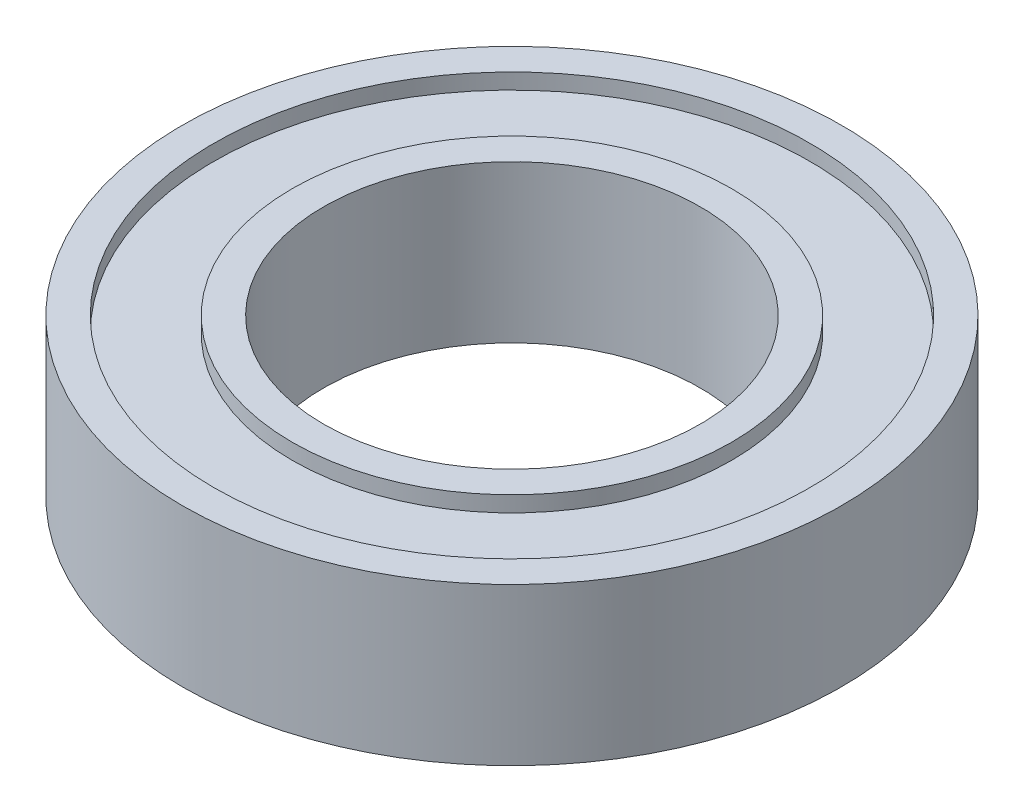
ISO-10303-21;
HEADER;
FILE_DESCRIPTION(('STEP AP214'),'2;1');
FILE_NAME('part.step','',(''),(''),'','','');
FILE_SCHEMA(('AUTOMOTIVE_DESIGN { 1 0 10303 214 1 1 1 1 }'));
ENDSEC;
DATA;
#1=APPLICATION_CONTEXT('core data for automotive mechanical design processes');
#2=APPLICATION_PROTOCOL_DEFINITION('international standard','automotive_design',2000,#1);
#3=PRODUCT_CONTEXT('',#1,'mechanical');
#4=PRODUCT('Part','Part','',(#3));
#5=PRODUCT_RELATED_PRODUCT_CATEGORY('part','',(#4));
#6=PRODUCT_DEFINITION_FORMATION('','',#4);
#7=PRODUCT_DEFINITION_CONTEXT('part definition',#1,'design');
#8=PRODUCT_DEFINITION('design','',#6,#7);
#9=PRODUCT_DEFINITION_SHAPE('','',#8);
#10=(LENGTH_UNIT() NAMED_UNIT(*) SI_UNIT(.MILLI.,.METRE.));
#11=(NAMED_UNIT(*) PLANE_ANGLE_UNIT() SI_UNIT($,.RADIAN.));
#12=(NAMED_UNIT(*) SI_UNIT($,.STERADIAN.) SOLID_ANGLE_UNIT());
#13=UNCERTAINTY_MEASURE_WITH_UNIT(LENGTH_MEASURE(1.E-05),#10,'distance_accuracy_value','');
#14=(GEOMETRIC_REPRESENTATION_CONTEXT(3) GLOBAL_UNCERTAINTY_ASSIGNED_CONTEXT((#13)) GLOBAL_UNIT_ASSIGNED_CONTEXT((#10,
#11,#12)) REPRESENTATION_CONTEXT('',''));
#15=CARTESIAN_POINT('',(0.,0.,0.));
#16=DIRECTION('',(0.,0.,1.));
#17=DIRECTION('',(1.,0.,0.));
#18=AXIS2_PLACEMENT_3D('',#15,#16,#17);
#19=CARTESIAN_POINT('',(0.,-2.5,0.));
#20=DIRECTION('',(0.,1.,0.));
#21=DIRECTION('',(0.,0.,1.));
#22=AXIS2_PLACEMENT_3D('',#19,#20,#21);
#23=CYLINDRICAL_SURFACE('',#22,7.);
#24=CARTESIAN_POINT('',(0.,-2.5,0.));
#25=DIRECTION('',(0.,1.,0.));
#26=DIRECTION('',(0.,0.,1.));
#27=AXIS2_PLACEMENT_3D('',#24,#25,#26);
#28=CIRCLE('',#27,7.);
#29=CARTESIAN_POINT('',(0.,-2.5,7.));
#30=VERTEX_POINT('',#29);
#31=EDGE_CURVE('E51',#30,#30,#28,.T.);
#32=ORIENTED_EDGE('',*,*,#31,.T.);
#33=EDGE_LOOP('',(#32));
#34=FACE_BOUND('',#33,.T.);
#35=CARTESIAN_POINT('',(0.,-2.,0.));
#36=DIRECTION('',(0.,1.,0.));
#37=DIRECTION('',(0.,0.,1.));
#38=AXIS2_PLACEMENT_3D('',#35,#36,#37);
#39=CIRCLE('',#38,7.);
#40=CARTESIAN_POINT('',(0.,-2.,7.));
#41=VERTEX_POINT('',#40);
#42=EDGE_CURVE('E70',#41,#41,#39,.T.);
#43=ORIENTED_EDGE('',*,*,#42,.F.);
#44=EDGE_LOOP('',(#43));
#45=FACE_BOUND('',#44,.T.);
#46=ADVANCED_FACE('F44',(#34,#45),#23,.T.);
#47=CARTESIAN_POINT('',(0.,-2.5,0.));
#48=DIRECTION('',(0.,1.,0.));
#49=DIRECTION('',(0.,0.,1.));
#50=AXIS2_PLACEMENT_3D('',#47,#48,#49);
#51=CYLINDRICAL_SURFACE('',#50,6.);
#52=CARTESIAN_POINT('',(0.,-2.5,0.));
#53=DIRECTION('',(0.,1.,0.));
#54=DIRECTION('',(0.,0.,1.));
#55=AXIS2_PLACEMENT_3D('',#52,#53,#54);
#56=CIRCLE('',#55,6.);
#57=CARTESIAN_POINT('',(0.,-2.5,6.));
#58=VERTEX_POINT('',#57);
#59=EDGE_CURVE('E55',#58,#58,#56,.T.);
#60=ORIENTED_EDGE('',*,*,#59,.F.);
#61=EDGE_LOOP('',(#60));
#62=FACE_BOUND('',#61,.T.);
#63=CARTESIAN_POINT('',(0.,2.5,0.));
#64=DIRECTION('',(0.,1.,0.));
#65=DIRECTION('',(0.,0.,1.));
#66=AXIS2_PLACEMENT_3D('',#63,#64,#65);
#67=CIRCLE('',#66,6.);
#68=CARTESIAN_POINT('',(0.,2.5,6.));
#69=VERTEX_POINT('',#68);
#70=EDGE_CURVE('E64',#69,#69,#67,.T.);
#71=ORIENTED_EDGE('',*,*,#70,.T.);
#72=EDGE_LOOP('',(#71));
#73=FACE_BOUND('',#72,.T.);
#74=ADVANCED_FACE('F46',(#62,#73),#51,.F.);
#75=CARTESIAN_POINT('',(0.,2.,0.));
#76=DIRECTION('',(0.,1.,0.));
#77=DIRECTION('',(0.,0.,1.));
#78=AXIS2_PLACEMENT_3D('',#75,#76,#77);
#79=CIRCLE('',#78,7.);
#80=CARTESIAN_POINT('',(0.,2.,7.));
#81=VERTEX_POINT('',#80);
#82=EDGE_CURVE('E11',#81,#81,#79,.F.);
#83=ORIENTED_EDGE('',*,*,#82,.F.);
#84=EDGE_LOOP('',(#83));
#85=FACE_BOUND('',#84,.T.);
#86=CARTESIAN_POINT('',(0.,2.5,0.));
#87=DIRECTION('',(0.,1.,0.));
#88=DIRECTION('',(0.,0.,1.));
#89=AXIS2_PLACEMENT_3D('',#86,#87,#88);
#90=CIRCLE('',#89,7.);
#91=CARTESIAN_POINT('',(0.,2.5,7.));
#92=VERTEX_POINT('',#91);
#93=EDGE_CURVE('E59',#92,#92,#90,.T.);
#94=ORIENTED_EDGE('',*,*,#93,.F.);
#95=EDGE_LOOP('',(#94));
#96=FACE_BOUND('',#95,.T.);
#97=ADVANCED_FACE('F112',(#85,#96),#23,.T.);
#98=CARTESIAN_POINT('',(0.,-2.5,0.));
#99=DIRECTION('',(0.,1.,0.));
#100=DIRECTION('',(0.,0.,1.));
#101=AXIS2_PLACEMENT_3D('',#98,#99,#100);
#102=PLANE('',#101);
#103=ORIENTED_EDGE('',*,*,#59,.T.);
#104=EDGE_LOOP('',(#103));
#105=FACE_BOUND('',#104,.T.);
#106=ORIENTED_EDGE('',*,*,#31,.F.);
#107=EDGE_LOOP('',(#106));
#108=FACE_BOUND('',#107,.T.);
#109=ADVANCED_FACE('F120',(#105,#108),#102,.F.);
#110=CARTESIAN_POINT('',(0.,2.5,0.));
#111=DIRECTION('',(0.,1.,0.));
#112=DIRECTION('',(0.,0.,1.));
#113=AXIS2_PLACEMENT_3D('',#110,#111,#112);
#114=PLANE('',#113);
#115=ORIENTED_EDGE('',*,*,#70,.F.);
#116=EDGE_LOOP('',(#115));
#117=FACE_BOUND('',#116,.T.);
#118=ORIENTED_EDGE('',*,*,#93,.T.);
#119=EDGE_LOOP('',(#118));
#120=FACE_BOUND('',#119,.T.);
#121=ADVANCED_FACE('F125',(#117,#120),#114,.T.);
#122=CARTESIAN_POINT('',(0.,-2.,0.));
#123=DIRECTION('',(0.,1.,0.));
#124=DIRECTION('',(0.,0.,1.));
#125=AXIS2_PLACEMENT_3D('',#122,#123,#124);
#126=PLANE('',#125);
#127=ORIENTED_EDGE('',*,*,#42,.T.);
#128=EDGE_LOOP('',(#127));
#129=FACE_BOUND('',#128,.T.);
#130=CARTESIAN_POINT('',(0.,-2.,0.));
#131=DIRECTION('',(0.,1.,0.));
#132=DIRECTION('',(0.,0.,1.));
#133=AXIS2_PLACEMENT_3D('',#130,#131,#132);
#134=CIRCLE('',#133,9.5);
#135=CARTESIAN_POINT('',(0.,-2.,9.5));
#136=VERTEX_POINT('',#135);
#137=EDGE_CURVE('E67',#136,#136,#134,.T.);
#138=ORIENTED_EDGE('',*,*,#137,.F.);
#139=EDGE_LOOP('',(#138));
#140=FACE_BOUND('',#139,.T.);
#141=ADVANCED_FACE('F131',(#129,#140),#126,.F.);
#142=CARTESIAN_POINT('',(0.,2.,0.));
#143=DIRECTION('',(0.,1.,0.));
#144=DIRECTION('',(0.,0.,1.));
#145=AXIS2_PLACEMENT_3D('',#142,#143,#144);
#146=PLANE('',#145);
#147=ORIENTED_EDGE('',*,*,#82,.T.);
#148=EDGE_LOOP('',(#147));
#149=FACE_BOUND('',#148,.T.);
#150=CARTESIAN_POINT('',(0.,2.,0.));
#151=DIRECTION('',(0.,1.,0.));
#152=DIRECTION('',(0.,0.,1.));
#153=AXIS2_PLACEMENT_3D('',#150,#151,#152);
#154=CIRCLE('',#153,9.5);
#155=CARTESIAN_POINT('',(0.,2.,9.5));
#156=VERTEX_POINT('',#155);
#157=EDGE_CURVE('E73',#156,#156,#154,.T.);
#158=ORIENTED_EDGE('',*,*,#157,.T.);
#159=EDGE_LOOP('',(#158));
#160=FACE_BOUND('',#159,.T.);
#161=ADVANCED_FACE('F137',(#149,#160),#146,.T.);
#162=CARTESIAN_POINT('',(0.,-2.5,0.));
#163=DIRECTION('',(0.,1.,0.));
#164=DIRECTION('',(0.,0.,1.));
#165=AXIS2_PLACEMENT_3D('',#162,#163,#164);
#166=CYLINDRICAL_SURFACE('',#165,9.5);
#167=CARTESIAN_POINT('',(0.,-2.5,0.));
#168=DIRECTION('',(0.,1.,0.));
#169=DIRECTION('',(0.,0.,1.));
#170=AXIS2_PLACEMENT_3D('',#167,#168,#169);
#171=CIRCLE('',#170,9.5);
#172=CARTESIAN_POINT('',(0.,-2.5,9.5));
#173=VERTEX_POINT('',#172);
#174=EDGE_CURVE('E79',#173,#173,#171,.T.);
#175=ORIENTED_EDGE('',*,*,#174,.F.);
#176=EDGE_LOOP('',(#175));
#177=FACE_BOUND('',#176,.T.);
#178=ORIENTED_EDGE('',*,*,#137,.T.);
#179=EDGE_LOOP('',(#178));
#180=FACE_BOUND('',#179,.T.);
#181=ADVANCED_FACE('F108',(#177,#180),#166,.F.);
#182=ORIENTED_EDGE('',*,*,#157,.F.);
#183=EDGE_LOOP('',(#182));
#184=FACE_BOUND('',#183,.T.);
#185=CARTESIAN_POINT('',(0.,2.5,0.));
#186=DIRECTION('',(0.,1.,0.));
#187=DIRECTION('',(0.,0.,1.));
#188=AXIS2_PLACEMENT_3D('',#185,#186,#187);
#189=CIRCLE('',#188,9.5);
#190=CARTESIAN_POINT('',(0.,2.5,9.5));
#191=VERTEX_POINT('',#190);
#192=EDGE_CURVE('E85',#191,#191,#189,.T.);
#193=ORIENTED_EDGE('',*,*,#192,.T.);
#194=EDGE_LOOP('',(#193));
#195=FACE_BOUND('',#194,.T.);
#196=ADVANCED_FACE('F89',(#184,#195),#166,.F.);
#197=CARTESIAN_POINT('',(0.,-2.5,0.));
#198=DIRECTION('',(0.,1.,0.));
#199=DIRECTION('',(0.,0.,1.));
#200=AXIS2_PLACEMENT_3D('',#197,#198,#199);
#201=CYLINDRICAL_SURFACE('',#200,10.5);
#202=CARTESIAN_POINT('',(0.,-2.5,0.));
#203=DIRECTION('',(0.,1.,0.));
#204=DIRECTION('',(0.,0.,1.));
#205=AXIS2_PLACEMENT_3D('',#202,#203,#204);
#206=CIRCLE('',#205,10.5);
#207=CARTESIAN_POINT('',(0.,-2.5,10.5));
#208=VERTEX_POINT('',#207);
#209=EDGE_CURVE('E76',#208,#208,#206,.T.);
#210=ORIENTED_EDGE('',*,*,#209,.T.);
#211=EDGE_LOOP('',(#210));
#212=FACE_BOUND('',#211,.T.);
#213=CARTESIAN_POINT('',(0.,2.5,0.));
#214=DIRECTION('',(0.,1.,0.));
#215=DIRECTION('',(0.,0.,1.));
#216=AXIS2_PLACEMENT_3D('',#213,#214,#215);
#217=CIRCLE('',#216,10.5);
#218=CARTESIAN_POINT('',(0.,2.5,10.5));
#219=VERTEX_POINT('',#218);
#220=EDGE_CURVE('E82',#219,#219,#217,.T.);
#221=ORIENTED_EDGE('',*,*,#220,.F.);
#222=EDGE_LOOP('',(#221));
#223=FACE_BOUND('',#222,.T.);
#224=ADVANCED_FACE('F98',(#212,#223),#201,.T.);
#225=CARTESIAN_POINT('',(0.,-2.5,0.));
#226=DIRECTION('',(0.,1.,0.));
#227=DIRECTION('',(0.,0.,1.));
#228=AXIS2_PLACEMENT_3D('',#225,#226,#227);
#229=PLANE('',#228);
#230=ORIENTED_EDGE('',*,*,#174,.T.);
#231=EDGE_LOOP('',(#230));
#232=FACE_BOUND('',#231,.T.);
#233=ORIENTED_EDGE('',*,*,#209,.F.);
#234=EDGE_LOOP('',(#233));
#235=FACE_BOUND('',#234,.T.);
#236=ADVANCED_FACE('F94',(#232,#235),#229,.F.);
#237=CARTESIAN_POINT('',(0.,2.5,0.));
#238=DIRECTION('',(0.,1.,0.));
#239=DIRECTION('',(0.,0.,1.));
#240=AXIS2_PLACEMENT_3D('',#237,#238,#239);
#241=PLANE('',#240);
#242=ORIENTED_EDGE('',*,*,#192,.F.);
#243=EDGE_LOOP('',(#242));
#244=FACE_BOUND('',#243,.T.);
#245=ORIENTED_EDGE('',*,*,#220,.T.);
#246=EDGE_LOOP('',(#245));
#247=FACE_BOUND('',#246,.T.);
#248=ADVANCED_FACE('F91',(#244,#247),#241,.T.);
#249=CLOSED_SHELL('',(#46,#74,#97,#109,#121,#141,#161,#181,#196,#224,#236,#248));
#250=MANIFOLD_SOLID_BREP('B2',#249);
#251=ADVANCED_BREP_SHAPE_REPRESENTATION('',(#18,#250),#14);
#252=SHAPE_DEFINITION_REPRESENTATION(#9,#251);
ENDSEC;
END-ISO-10303-21;
